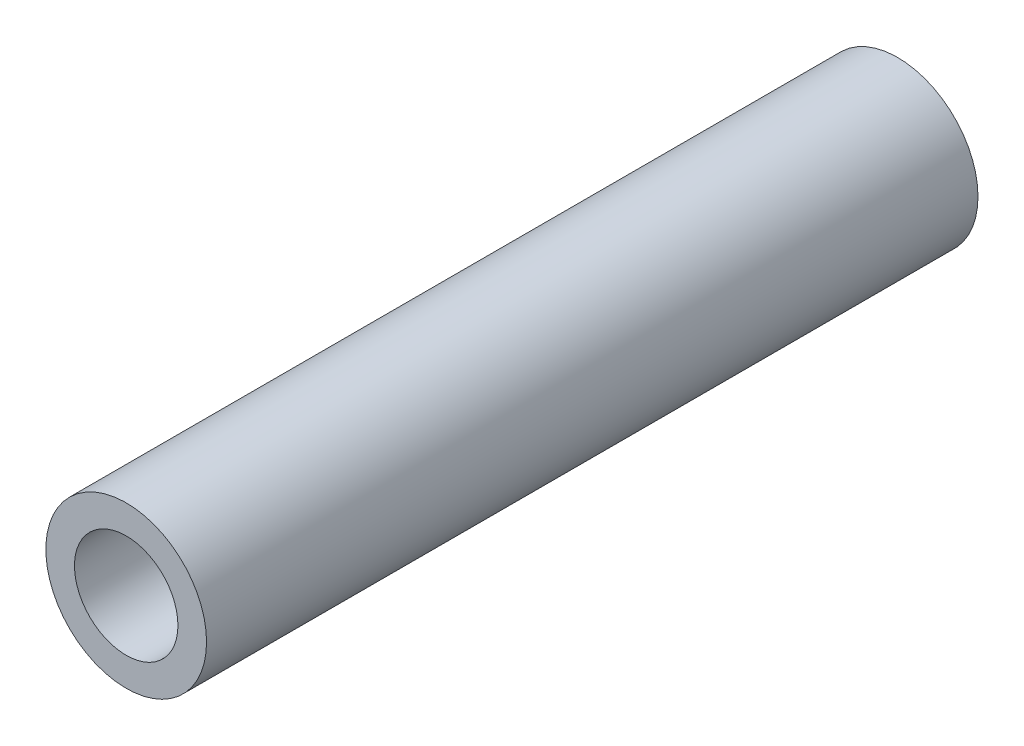
ISO-10303-21;
HEADER;
FILE_DESCRIPTION(('STEP AP214'),'2;1');
FILE_NAME('part.step','',(''),(''),'','','');
FILE_SCHEMA(('AUTOMOTIVE_DESIGN { 1 0 10303 214 1 1 1 1 }'));
ENDSEC;
DATA;
#1=APPLICATION_CONTEXT('core data for automotive mechanical design processes');
#2=APPLICATION_PROTOCOL_DEFINITION('international standard','automotive_design',2000,#1);
#3=PRODUCT_CONTEXT('',#1,'mechanical');
#4=PRODUCT('Part','Part','',(#3));
#5=PRODUCT_RELATED_PRODUCT_CATEGORY('part','',(#4));
#6=PRODUCT_DEFINITION_FORMATION('','',#4);
#7=PRODUCT_DEFINITION_CONTEXT('part definition',#1,'design');
#8=PRODUCT_DEFINITION('design','',#6,#7);
#9=PRODUCT_DEFINITION_SHAPE('','',#8);
#10=(LENGTH_UNIT() NAMED_UNIT(*) SI_UNIT(.MILLI.,.METRE.));
#11=(NAMED_UNIT(*) PLANE_ANGLE_UNIT() SI_UNIT($,.RADIAN.));
#12=(NAMED_UNIT(*) SI_UNIT($,.STERADIAN.) SOLID_ANGLE_UNIT());
#13=UNCERTAINTY_MEASURE_WITH_UNIT(LENGTH_MEASURE(1.E-05),#10,'distance_accuracy_value','');
#14=(GEOMETRIC_REPRESENTATION_CONTEXT(3) GLOBAL_UNCERTAINTY_ASSIGNED_CONTEXT((#13)) GLOBAL_UNIT_ASSIGNED_CONTEXT((#10,
#11,#12)) REPRESENTATION_CONTEXT('',''));
#15=CARTESIAN_POINT('',(0.,0.,0.));
#16=DIRECTION('',(0.,0.,1.));
#17=DIRECTION('',(1.,0.,0.));
#18=AXIS2_PLACEMENT_3D('',#15,#16,#17);
#19=CARTESIAN_POINT('',(0.,0.,38.1));
#20=DIRECTION('',(0.,0.,1.));
#21=DIRECTION('',(1.,0.,0.));
#22=AXIS2_PLACEMENT_3D('',#19,#20,#21);
#23=PLANE('',#22);
#24=CARTESIAN_POINT('',(0.,0.,38.1));
#25=DIRECTION('',(0.,0.,1.));
#26=DIRECTION('',(1.,0.,0.));
#27=AXIS2_PLACEMENT_3D('',#24,#25,#26);
#28=CIRCLE('',#27,3.96875);
#29=CARTESIAN_POINT('',(3.96875,0.,38.1));
#30=VERTEX_POINT('',#29);
#31=EDGE_CURVE('E10',#30,#30,#28,.T.);
#32=ORIENTED_EDGE('',*,*,#31,.T.);
#33=EDGE_LOOP('',(#32));
#34=FACE_BOUND('',#33,.T.);
#35=CARTESIAN_POINT('',(0.,0.,38.1));
#36=DIRECTION('',(0.,0.,1.));
#37=DIRECTION('',(1.,0.,0.));
#38=AXIS2_PLACEMENT_3D('',#35,#36,#37);
#39=CIRCLE('',#38,2.555);
#40=CARTESIAN_POINT('',(2.555,0.,38.1));
#41=VERTEX_POINT('',#40);
#42=EDGE_CURVE('E45',#41,#41,#39,.T.);
#43=ORIENTED_EDGE('',*,*,#42,.F.);
#44=EDGE_LOOP('',(#43));
#45=FACE_BOUND('',#44,.T.);
#46=ADVANCED_FACE('F34',(#34,#45),#23,.T.);
#47=CARTESIAN_POINT('',(0.,0.,0.));
#48=DIRECTION('',(0.,0.,1.));
#49=DIRECTION('',(1.,0.,0.));
#50=AXIS2_PLACEMENT_3D('',#47,#48,#49);
#51=PLANE('',#50);
#52=CARTESIAN_POINT('',(0.,0.,0.));
#53=DIRECTION('',(0.,0.,1.));
#54=DIRECTION('',(1.,0.,0.));
#55=AXIS2_PLACEMENT_3D('',#52,#53,#54);
#56=CIRCLE('',#55,3.96875);
#57=CARTESIAN_POINT('',(3.96875,0.,0.));
#58=VERTEX_POINT('',#57);
#59=EDGE_CURVE('E38',#58,#58,#56,.T.);
#60=ORIENTED_EDGE('',*,*,#59,.F.);
#61=EDGE_LOOP('',(#60));
#62=FACE_BOUND('',#61,.T.);
#63=CARTESIAN_POINT('',(0.,0.,0.));
#64=DIRECTION('',(0.,0.,1.));
#65=DIRECTION('',(1.,0.,0.));
#66=AXIS2_PLACEMENT_3D('',#63,#64,#65);
#67=CIRCLE('',#66,2.555);
#68=CARTESIAN_POINT('',(2.555,0.,0.));
#69=VERTEX_POINT('',#68);
#70=EDGE_CURVE('E47',#69,#69,#67,.T.);
#71=ORIENTED_EDGE('',*,*,#70,.T.);
#72=EDGE_LOOP('',(#71));
#73=FACE_BOUND('',#72,.T.);
#74=ADVANCED_FACE('F57',(#62,#73),#51,.F.);
#75=CARTESIAN_POINT('',(0.,0.,38.1));
#76=DIRECTION('',(0.,0.,-1.));
#77=DIRECTION('',(-1.,0.,0.));
#78=AXIS2_PLACEMENT_3D('',#75,#76,#77);
#79=CYLINDRICAL_SURFACE('',#78,3.96875);
#80=ORIENTED_EDGE('',*,*,#31,.F.);
#81=EDGE_LOOP('',(#80));
#82=FACE_BOUND('',#81,.T.);
#83=ORIENTED_EDGE('',*,*,#59,.T.);
#84=EDGE_LOOP('',(#83));
#85=FACE_BOUND('',#84,.T.);
#86=ADVANCED_FACE('F36',(#82,#85),#79,.T.);
#87=CARTESIAN_POINT('',(0.,0.,38.1));
#88=DIRECTION('',(0.,0.,-1.));
#89=DIRECTION('',(-1.,0.,0.));
#90=AXIS2_PLACEMENT_3D('',#87,#88,#89);
#91=CYLINDRICAL_SURFACE('',#90,2.555);
#92=ORIENTED_EDGE('',*,*,#42,.T.);
#93=EDGE_LOOP('',(#92));
#94=FACE_BOUND('',#93,.T.);
#95=ORIENTED_EDGE('',*,*,#70,.F.);
#96=EDGE_LOOP('',(#95));
#97=FACE_BOUND('',#96,.T.);
#98=ADVANCED_FACE('F53',(#94,#97),#91,.F.);
#99=CLOSED_SHELL('',(#46,#74,#86,#98));
#100=MANIFOLD_SOLID_BREP('B2',#99);
#101=ADVANCED_BREP_SHAPE_REPRESENTATION('',(#18,#100),#14);
#102=SHAPE_DEFINITION_REPRESENTATION(#9,#101);
ENDSEC;
END-ISO-10303-21;
